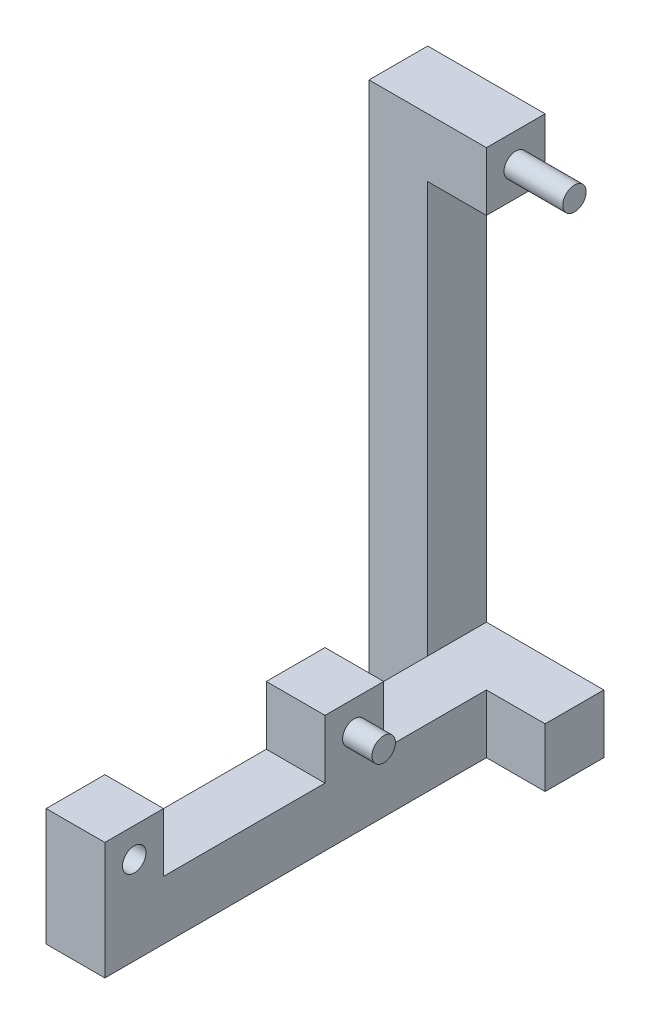
ISO-10303-21;
HEADER;
FILE_DESCRIPTION(('STEP AP214'),'2;1');
FILE_NAME('part.step','',(''),(''),'','','');
FILE_SCHEMA(('AUTOMOTIVE_DESIGN { 1 0 10303 214 1 1 1 1 }'));
ENDSEC;
DATA;
#1=APPLICATION_CONTEXT('core data for automotive mechanical design processes');
#2=APPLICATION_PROTOCOL_DEFINITION('international standard','automotive_design',2000,#1);
#3=PRODUCT_CONTEXT('',#1,'mechanical');
#4=PRODUCT('Part','Part','',(#3));
#5=PRODUCT_RELATED_PRODUCT_CATEGORY('part','',(#4));
#6=PRODUCT_DEFINITION_FORMATION('','',#4);
#7=PRODUCT_DEFINITION_CONTEXT('part definition',#1,'design');
#8=PRODUCT_DEFINITION('design','',#6,#7);
#9=PRODUCT_DEFINITION_SHAPE('','',#8);
#10=(LENGTH_UNIT() NAMED_UNIT(*) SI_UNIT(.MILLI.,.METRE.));
#11=(NAMED_UNIT(*) PLANE_ANGLE_UNIT() SI_UNIT($,.RADIAN.));
#12=(NAMED_UNIT(*) SI_UNIT($,.STERADIAN.) SOLID_ANGLE_UNIT());
#13=UNCERTAINTY_MEASURE_WITH_UNIT(LENGTH_MEASURE(1.E-05),#10,'distance_accuracy_value','');
#14=(GEOMETRIC_REPRESENTATION_CONTEXT(3) GLOBAL_UNCERTAINTY_ASSIGNED_CONTEXT((#13)) GLOBAL_UNIT_ASSIGNED_CONTEXT((#10,
#11,#12)) REPRESENTATION_CONTEXT('',''));
#15=CARTESIAN_POINT('',(0.,0.,0.));
#16=DIRECTION('',(0.,0.,1.));
#17=DIRECTION('',(1.,0.,0.));
#18=AXIS2_PLACEMENT_3D('',#15,#16,#17);
#19=CARTESIAN_POINT('',(400.,1700.,100.));
#20=DIRECTION('',(-1.,0.,0.));
#21=DIRECTION('',(0.,0.,1.));
#22=AXIS2_PLACEMENT_3D('',#19,#20,#21);
#23=CYLINDRICAL_SURFACE('',#22,40.);
#24=CARTESIAN_POINT('',(400.,1700.,100.));
#25=DIRECTION('',(1.,0.,0.));
#26=DIRECTION('',(0.,0.,-1.));
#27=AXIS2_PLACEMENT_3D('',#24,#25,#26);
#28=CIRCLE('',#27,40.);
#29=CARTESIAN_POINT('',(400.,1700.,60.));
#30=VERTEX_POINT('',#29);
#31=EDGE_CURVE('E12',#30,#30,#28,.T.);
#32=ORIENTED_EDGE('',*,*,#31,.F.);
#33=EDGE_LOOP('',(#32));
#34=FACE_BOUND('',#33,.T.);
#35=CARTESIAN_POINT('',(0.,1700.,100.));
#36=DIRECTION('',(1.,0.,0.));
#37=DIRECTION('',(0.,0.,-1.));
#38=AXIS2_PLACEMENT_3D('',#35,#36,#37);
#39=CIRCLE('',#38,40.);
#40=CARTESIAN_POINT('',(0.,1700.,60.));
#41=VERTEX_POINT('',#40);
#42=EDGE_CURVE('E74',#41,#41,#39,.T.);
#43=ORIENTED_EDGE('',*,*,#42,.T.);
#44=EDGE_LOOP('',(#43));
#45=FACE_BOUND('',#44,.T.);
#46=ADVANCED_FACE('F71',(#34,#45),#23,.T.);
#47=CARTESIAN_POINT('',(400.,1700.,100.));
#48=DIRECTION('',(1.,0.,0.));
#49=DIRECTION('',(0.,0.,-1.));
#50=AXIS2_PLACEMENT_3D('',#47,#48,#49);
#51=PLANE('',#50);
#52=ORIENTED_EDGE('',*,*,#31,.T.);
#53=EDGE_LOOP('',(#52));
#54=FACE_BOUND('',#53,.T.);
#55=ADVANCED_FACE('F86',(#54),#51,.T.);
#56=CARTESIAN_POINT('',(0.,1700.,100.));
#57=DIRECTION('',(1.,0.,0.));
#58=DIRECTION('',(0.,0.,-1.));
#59=AXIS2_PLACEMENT_3D('',#56,#57,#58);
#60=PLANE('',#59);
#61=ORIENTED_EDGE('',*,*,#42,.F.);
#62=EDGE_LOOP('',(#61));
#63=FACE_BOUND('',#62,.T.);
#64=ADVANCED_FACE('F84',(#63),#60,.F.);
#65=CLOSED_SHELL('',(#46,#55,#64));
#66=MANIFOLD_SOLID_BREP('B2',#65);
#67=CARTESIAN_POINT('',(200.,0.,0.));
#68=DIRECTION('',(-1.,0.,0.));
#69=DIRECTION('',(0.,0.,1.));
#70=AXIS2_PLACEMENT_3D('',#67,#68,#69);
#71=PLANE('',#70);
#72=CARTESIAN_POINT('',(200.,300.,1400.));
#73=DIRECTION('',(-1.,0.,0.));
#74=DIRECTION('',(0.,0.,1.));
#75=AXIS2_PLACEMENT_3D('',#72,#73,#74);
#76=CIRCLE('',#75,39.9999999999999);
#77=CARTESIAN_POINT('',(200.,300.,1440.));
#78=VERTEX_POINT('',#77);
#79=EDGE_CURVE('E265',#78,#78,#76,.T.);
#80=ORIENTED_EDGE('',*,*,#79,.T.);
#81=EDGE_LOOP('',(#80));
#82=FACE_BOUND('',#81,.T.);
#83=CARTESIAN_POINT('',(200.,300.,650.));
#84=DIRECTION('',(-1.,0.,0.));
#85=DIRECTION('',(0.,0.,1.));
#86=AXIS2_PLACEMENT_3D('',#83,#84,#85);
#87=CIRCLE('',#86,39.9999999999999);
#88=CARTESIAN_POINT('',(200.,300.,690.));
#89=VERTEX_POINT('',#88);
#90=EDGE_CURVE('E69',#89,#89,#87,.F.);
#91=ORIENTED_EDGE('',*,*,#90,.F.);
#92=EDGE_LOOP('',(#91));
#93=FACE_BOUND('',#92,.T.);
#94=DIRECTION('',(0.,-1.,0.));
#95=VECTOR('',#94,1.);
#96=CARTESIAN_POINT('',(200.,0.,200.));
#97=LINE('',#96,#95);
#98=CARTESIAN_POINT('',(200.,200.,200.));
#99=VERTEX_POINT('',#98);
#100=CARTESIAN_POINT('',(200.,0.,200.));
#101=VERTEX_POINT('',#100);
#102=EDGE_CURVE('E272',#99,#101,#97,.T.);
#103=ORIENTED_EDGE('',*,*,#102,.F.);
#104=DIRECTION('',(0.,0.,1.));
#105=VECTOR('',#104,1.);
#106=CARTESIAN_POINT('',(200.,200.,0.));
#107=LINE('',#106,#105);
#108=CARTESIAN_POINT('',(200.,200.,550.));
#109=VERTEX_POINT('',#108);
#110=EDGE_CURVE('E314',#99,#109,#107,.T.);
#111=ORIENTED_EDGE('',*,*,#110,.T.);
#112=DIRECTION('',(0.,1.,0.));
#113=VECTOR('',#112,1.);
#114=CARTESIAN_POINT('',(200.,200.,550.));
#115=LINE('',#114,#113);
#116=CARTESIAN_POINT('',(200.,400.,550.));
#117=VERTEX_POINT('',#116);
#118=EDGE_CURVE('E360',#109,#117,#115,.T.);
#119=ORIENTED_EDGE('',*,*,#118,.T.);
#120=DIRECTION('',(0.,0.,-1.));
#121=VECTOR('',#120,1.);
#122=CARTESIAN_POINT('',(200.,400.,750.));
#123=LINE('',#122,#121);
#124=CARTESIAN_POINT('',(200.,400.,750.));
#125=VERTEX_POINT('',#124);
#126=EDGE_CURVE('E356',#125,#117,#123,.T.);
#127=ORIENTED_EDGE('',*,*,#126,.F.);
#128=DIRECTION('',(0.,1.,0.));
#129=VECTOR('',#128,1.);
#130=CARTESIAN_POINT('',(200.,200.,750.));
#131=LINE('',#130,#129);
#132=CARTESIAN_POINT('',(200.,200.,750.));
#133=VERTEX_POINT('',#132);
#134=EDGE_CURVE('E353',#133,#125,#131,.T.);
#135=ORIENTED_EDGE('',*,*,#134,.F.);
#136=CARTESIAN_POINT('',(200.,200.,1300.));
#137=VERTEX_POINT('',#136);
#138=EDGE_CURVE('E317',#133,#137,#107,.T.);
#139=ORIENTED_EDGE('',*,*,#138,.T.);
#140=DIRECTION('',(0.,1.,0.));
#141=VECTOR('',#140,1.);
#142=CARTESIAN_POINT('',(200.,200.,1300.));
#143=LINE('',#142,#141);
#144=CARTESIAN_POINT('',(200.,400.,1300.));
#145=VERTEX_POINT('',#144);
#146=EDGE_CURVE('E333',#137,#145,#143,.T.);
#147=ORIENTED_EDGE('',*,*,#146,.T.);
#148=DIRECTION('',(0.,0.,-1.));
#149=VECTOR('',#148,1.);
#150=CARTESIAN_POINT('',(200.,400.,1500.));
#151=LINE('',#150,#149);
#152=CARTESIAN_POINT('',(200.,400.,1500.));
#153=VERTEX_POINT('',#152);
#154=EDGE_CURVE('E335',#153,#145,#151,.T.);
#155=ORIENTED_EDGE('',*,*,#154,.F.);
#156=DIRECTION('',(0.,1.,0.));
#157=VECTOR('',#156,1.);
#158=CARTESIAN_POINT('',(200.,0.,1500.));
#159=LINE('',#158,#157);
#160=CARTESIAN_POINT('',(200.,0.,1500.));
#161=VERTEX_POINT('',#160);
#162=EDGE_CURVE('E316',#161,#153,#159,.T.);
#163=ORIENTED_EDGE('',*,*,#162,.F.);
#164=DIRECTION('',(0.,0.,1.));
#165=VECTOR('',#164,1.);
#166=CARTESIAN_POINT('',(200.,0.,0.));
#167=LINE('',#166,#165);
#168=EDGE_CURVE('E248',#101,#161,#167,.T.);
#169=ORIENTED_EDGE('',*,*,#168,.F.);
#170=EDGE_LOOP('',(#103,#111,#119,#127,#135,#139,#147,#155,#163,#169));
#171=FACE_BOUND('',#170,.T.);
#172=ADVANCED_FACE('F114',(#82,#93,#171),#71,.F.);
#173=CARTESIAN_POINT('',(0.,0.,0.));
#174=DIRECTION('',(1.,0.,0.));
#175=DIRECTION('',(0.,0.,-1.));
#176=AXIS2_PLACEMENT_3D('',#173,#174,#175);
#177=PLANE('',#176);
#178=DIRECTION('',(0.,1.,0.));
#179=VECTOR('',#178,1.);
#180=CARTESIAN_POINT('',(0.,0.,0.));
#181=LINE('',#180,#179);
#182=CARTESIAN_POINT('',(0.,200.,0.));
#183=VERTEX_POINT('',#182);
#184=CARTESIAN_POINT('',(0.,1600.,0.));
#185=VERTEX_POINT('',#184);
#186=EDGE_CURVE('E139',#183,#185,#181,.T.);
#187=ORIENTED_EDGE('',*,*,#186,.T.);
#188=DIRECTION('',(0.,0.,-1.));
#189=VECTOR('',#188,1.);
#190=CARTESIAN_POINT('',(0.,1600.,200.));
#191=LINE('',#190,#189);
#192=CARTESIAN_POINT('',(0.,1600.,200.));
#193=VERTEX_POINT('',#192);
#194=EDGE_CURVE('E274',#193,#185,#191,.T.);
#195=ORIENTED_EDGE('',*,*,#194,.F.);
#196=DIRECTION('',(0.,-1.,0.));
#197=VECTOR('',#196,1.);
#198=CARTESIAN_POINT('',(0.,0.,200.));
#199=LINE('',#198,#197);
#200=CARTESIAN_POINT('',(0.,200.,200.));
#201=VERTEX_POINT('',#200);
#202=EDGE_CURVE('E296',#193,#201,#199,.T.);
#203=ORIENTED_EDGE('',*,*,#202,.T.);
#204=DIRECTION('',(0.,0.,1.));
#205=VECTOR('',#204,1.);
#206=CARTESIAN_POINT('',(0.,200.,0.));
#207=LINE('',#206,#205);
#208=EDGE_CURVE('E320',#183,#201,#207,.T.);
#209=ORIENTED_EDGE('',*,*,#208,.F.);
#210=EDGE_LOOP('',(#187,#195,#203,#209));
#211=FACE_BOUND('',#210,.T.);
#212=ADVANCED_FACE('F419',(#211),#177,.T.);
#213=CARTESIAN_POINT('',(0.,0.,0.));
#214=DIRECTION('',(-1.,0.,0.));
#215=DIRECTION('',(0.,0.,1.));
#216=AXIS2_PLACEMENT_3D('',#213,#214,#215);
#217=PLANE('',#216);
#218=CARTESIAN_POINT('',(0.,300.,1400.));
#219=DIRECTION('',(-1.,0.,0.));
#220=DIRECTION('',(0.,0.,1.));
#221=AXIS2_PLACEMENT_3D('',#218,#219,#220);
#222=CIRCLE('',#221,39.9999999999999);
#223=CARTESIAN_POINT('',(0.,300.,1440.));
#224=VERTEX_POINT('',#223);
#225=EDGE_CURVE('E118',#224,#224,#222,.T.);
#226=ORIENTED_EDGE('',*,*,#225,.F.);
#227=EDGE_LOOP('',(#226));
#228=FACE_BOUND('',#227,.T.);
#229=CARTESIAN_POINT('',(0.,200.,550.));
#230=VERTEX_POINT('',#229);
#231=EDGE_CURVE('E323',#201,#230,#207,.T.);
#232=ORIENTED_EDGE('',*,*,#231,.F.);
#233=CARTESIAN_POINT('',(0.,0.,200.));
#234=VERTEX_POINT('',#233);
#235=EDGE_CURVE('E123',#201,#234,#199,.T.);
#236=ORIENTED_EDGE('',*,*,#235,.T.);
#237=DIRECTION('',(0.,0.,1.));
#238=VECTOR('',#237,1.);
#239=CARTESIAN_POINT('',(0.,0.,0.));
#240=LINE('',#239,#238);
#241=CARTESIAN_POINT('',(0.,0.,1500.));
#242=VERTEX_POINT('',#241);
#243=EDGE_CURVE('E326',#234,#242,#240,.T.);
#244=ORIENTED_EDGE('',*,*,#243,.T.);
#245=DIRECTION('',(0.,1.,0.));
#246=VECTOR('',#245,1.);
#247=CARTESIAN_POINT('',(0.,0.,1500.));
#248=LINE('',#247,#246);
#249=CARTESIAN_POINT('',(0.,400.,1500.));
#250=VERTEX_POINT('',#249);
#251=EDGE_CURVE('E322',#242,#250,#248,.T.);
#252=ORIENTED_EDGE('',*,*,#251,.T.);
#253=DIRECTION('',(0.,0.,-1.));
#254=VECTOR('',#253,1.);
#255=CARTESIAN_POINT('',(0.,400.,1500.));
#256=LINE('',#255,#254);
#257=CARTESIAN_POINT('',(0.,400.,1300.));
#258=VERTEX_POINT('',#257);
#259=EDGE_CURVE('E336',#250,#258,#256,.T.);
#260=ORIENTED_EDGE('',*,*,#259,.T.);
#261=DIRECTION('',(0.,1.,0.));
#262=VECTOR('',#261,1.);
#263=CARTESIAN_POINT('',(0.,200.,1300.));
#264=LINE('',#263,#262);
#265=CARTESIAN_POINT('',(0.,200.,1300.));
#266=VERTEX_POINT('',#265);
#267=EDGE_CURVE('E340',#266,#258,#264,.T.);
#268=ORIENTED_EDGE('',*,*,#267,.F.);
#269=CARTESIAN_POINT('',(0.,200.,750.));
#270=VERTEX_POINT('',#269);
#271=EDGE_CURVE('E324',#270,#266,#207,.T.);
#272=ORIENTED_EDGE('',*,*,#271,.F.);
#273=DIRECTION('',(0.,1.,0.));
#274=VECTOR('',#273,1.);
#275=CARTESIAN_POINT('',(0.,200.,750.));
#276=LINE('',#275,#274);
#277=CARTESIAN_POINT('',(0.,400.,750.));
#278=VERTEX_POINT('',#277);
#279=EDGE_CURVE('E310',#270,#278,#276,.T.);
#280=ORIENTED_EDGE('',*,*,#279,.T.);
#281=DIRECTION('',(0.,0.,-1.));
#282=VECTOR('',#281,1.);
#283=CARTESIAN_POINT('',(0.,400.,750.));
#284=LINE('',#283,#282);
#285=CARTESIAN_POINT('',(0.,400.,550.));
#286=VERTEX_POINT('',#285);
#287=EDGE_CURVE('E365',#278,#286,#284,.T.);
#288=ORIENTED_EDGE('',*,*,#287,.T.);
#289=DIRECTION('',(0.,1.,0.));
#290=VECTOR('',#289,1.);
#291=CARTESIAN_POINT('',(0.,200.,550.));
#292=LINE('',#291,#290);
#293=EDGE_CURVE('E357',#230,#286,#292,.T.);
#294=ORIENTED_EDGE('',*,*,#293,.F.);
#295=EDGE_LOOP('',(#232,#236,#244,#252,#260,#268,#272,#280,#288,#294));
#296=FACE_BOUND('',#295,.T.);
#297=ADVANCED_FACE('F385',(#228,#296),#217,.T.);
#298=CARTESIAN_POINT('',(200.,0.,0.));
#299=DIRECTION('',(0.,-1.,0.));
#300=DIRECTION('',(0.,0.,-1.));
#301=AXIS2_PLACEMENT_3D('',#298,#299,#300);
#302=PLANE('',#301);
#303=DIRECTION('',(-1.,0.,0.));
#304=VECTOR('',#303,1.);
#305=CARTESIAN_POINT('',(400.,0.,200.));
#306=LINE('',#305,#304);
#307=CARTESIAN_POINT('',(400.,0.,200.));
#308=VERTEX_POINT('',#307);
#309=EDGE_CURVE('E131',#308,#101,#306,.T.);
#310=ORIENTED_EDGE('',*,*,#309,.T.);
#311=ORIENTED_EDGE('',*,*,#168,.T.);
#312=DIRECTION('',(-1.,0.,0.));
#313=VECTOR('',#312,1.);
#314=CARTESIAN_POINT('',(200.,0.,1500.));
#315=LINE('',#314,#313);
#316=EDGE_CURVE('E329',#161,#242,#315,.T.);
#317=ORIENTED_EDGE('',*,*,#316,.T.);
#318=ORIENTED_EDGE('',*,*,#243,.F.);
#319=DIRECTION('',(1.,0.,0.));
#320=VECTOR('',#319,1.);
#321=CARTESIAN_POINT('',(-200.,0.,200.));
#322=LINE('',#321,#320);
#323=CARTESIAN_POINT('',(-200.,0.,200.));
#324=VERTEX_POINT('',#323);
#325=EDGE_CURVE('E308',#324,#234,#322,.T.);
#326=ORIENTED_EDGE('',*,*,#325,.F.);
#327=DIRECTION('',(0.,0.,-1.));
#328=VECTOR('',#327,1.);
#329=CARTESIAN_POINT('',(-200.,0.,0.));
#330=LINE('',#329,#328);
#331=CARTESIAN_POINT('',(-200.,0.,0.));
#332=VERTEX_POINT('',#331);
#333=EDGE_CURVE('E302',#324,#332,#330,.T.);
#334=ORIENTED_EDGE('',*,*,#333,.T.);
#335=DIRECTION('',(-1.,0.,0.));
#336=VECTOR('',#335,1.);
#337=CARTESIAN_POINT('',(200.,0.,0.));
#338=LINE('',#337,#336);
#339=CARTESIAN_POINT('',(400.,0.,0.));
#340=VERTEX_POINT('',#339);
#341=EDGE_CURVE('E247',#340,#332,#338,.T.);
#342=ORIENTED_EDGE('',*,*,#341,.F.);
#343=DIRECTION('',(0.,0.,-1.));
#344=VECTOR('',#343,1.);
#345=CARTESIAN_POINT('',(400.,0.,0.));
#346=LINE('',#345,#344);
#347=EDGE_CURVE('E261',#308,#340,#346,.T.);
#348=ORIENTED_EDGE('',*,*,#347,.F.);
#349=EDGE_LOOP('',(#310,#311,#317,#318,#326,#334,#342,#348));
#350=FACE_BOUND('',#349,.T.);
#351=ADVANCED_FACE('F400',(#350),#302,.T.);
#352=CARTESIAN_POINT('',(200.,0.,1500.));
#353=DIRECTION('',(0.,0.,1.));
#354=DIRECTION('',(1.,0.,0.));
#355=AXIS2_PLACEMENT_3D('',#352,#353,#354);
#356=PLANE('',#355);
#357=ORIENTED_EDGE('',*,*,#251,.F.);
#358=ORIENTED_EDGE('',*,*,#316,.F.);
#359=ORIENTED_EDGE('',*,*,#162,.T.);
#360=DIRECTION('',(-1.,0.,0.));
#361=VECTOR('',#360,1.);
#362=CARTESIAN_POINT('',(200.,400.,1500.));
#363=LINE('',#362,#361);
#364=EDGE_CURVE('E339',#153,#250,#363,.T.);
#365=ORIENTED_EDGE('',*,*,#364,.T.);
#366=EDGE_LOOP('',(#357,#358,#359,#365));
#367=FACE_BOUND('',#366,.T.);
#368=ADVANCED_FACE('F427',(#367),#356,.T.);
#369=CARTESIAN_POINT('',(200.,0.,0.));
#370=DIRECTION('',(0.,0.,1.));
#371=DIRECTION('',(1.,0.,0.));
#372=AXIS2_PLACEMENT_3D('',#369,#370,#371);
#373=PLANE('',#372);
#374=ORIENTED_EDGE('',*,*,#341,.T.);
#375=DIRECTION('',(0.,1.,0.));
#376=VECTOR('',#375,1.);
#377=CARTESIAN_POINT('',(-200.,0.,0.));
#378=LINE('',#377,#376);
#379=CARTESIAN_POINT('',(-200.,1800.,0.));
#380=VERTEX_POINT('',#379);
#381=EDGE_CURVE('E292',#332,#380,#378,.T.);
#382=ORIENTED_EDGE('',*,*,#381,.T.);
#383=DIRECTION('',(1.,0.,0.));
#384=VECTOR('',#383,1.);
#385=CARTESIAN_POINT('',(-200.,1800.,0.));
#386=LINE('',#385,#384);
#387=CARTESIAN_POINT('',(200.,1800.,0.));
#388=VERTEX_POINT('',#387);
#389=EDGE_CURVE('E305',#380,#388,#386,.T.);
#390=ORIENTED_EDGE('',*,*,#389,.T.);
#391=DIRECTION('',(0.,1.,0.));
#392=VECTOR('',#391,1.);
#393=CARTESIAN_POINT('',(200.,1800.,0.));
#394=LINE('',#393,#392);
#395=CARTESIAN_POINT('',(200.,1600.,0.));
#396=VERTEX_POINT('',#395);
#397=EDGE_CURVE('E280',#396,#388,#394,.T.);
#398=ORIENTED_EDGE('',*,*,#397,.F.);
#399=DIRECTION('',(-1.,0.,0.));
#400=VECTOR('',#399,1.);
#401=CARTESIAN_POINT('',(200.,1600.,0.));
#402=LINE('',#401,#400);
#403=EDGE_CURVE('E286',#396,#185,#402,.T.);
#404=ORIENTED_EDGE('',*,*,#403,.T.);
#405=ORIENTED_EDGE('',*,*,#186,.F.);
#406=DIRECTION('',(-1.,0.,0.));
#407=VECTOR('',#406,1.);
#408=CARTESIAN_POINT('',(200.,200.,0.));
#409=LINE('',#408,#407);
#410=CARTESIAN_POINT('',(400.,200.,0.));
#411=VERTEX_POINT('',#410);
#412=EDGE_CURVE('E239',#411,#183,#409,.T.);
#413=ORIENTED_EDGE('',*,*,#412,.F.);
#414=DIRECTION('',(0.,1.,0.));
#415=VECTOR('',#414,1.);
#416=CARTESIAN_POINT('',(400.,0.,0.));
#417=LINE('',#416,#415);
#418=EDGE_CURVE('E243',#340,#411,#417,.T.);
#419=ORIENTED_EDGE('',*,*,#418,.F.);
#420=EDGE_LOOP('',(#374,#382,#390,#398,#404,#405,#413,#419));
#421=FACE_BOUND('',#420,.T.);
#422=ADVANCED_FACE('F241',(#421),#373,.F.);
#423=CARTESIAN_POINT('',(200.,200.,0.));
#424=DIRECTION('',(0.,-1.,0.));
#425=DIRECTION('',(0.,0.,-1.));
#426=AXIS2_PLACEMENT_3D('',#423,#424,#425);
#427=PLANE('',#426);
#428=DIRECTION('',(-1.,0.,0.));
#429=VECTOR('',#428,1.);
#430=CARTESIAN_POINT('',(200.,200.,1300.));
#431=LINE('',#430,#429);
#432=EDGE_CURVE('E350',#137,#266,#431,.T.);
#433=ORIENTED_EDGE('',*,*,#432,.F.);
#434=ORIENTED_EDGE('',*,*,#138,.F.);
#435=DIRECTION('',(-1.,0.,0.));
#436=VECTOR('',#435,1.);
#437=CARTESIAN_POINT('',(200.,200.,750.));
#438=LINE('',#437,#436);
#439=EDGE_CURVE('E332',#133,#270,#438,.T.);
#440=ORIENTED_EDGE('',*,*,#439,.T.);
#441=ORIENTED_EDGE('',*,*,#271,.T.);
#442=EDGE_LOOP('',(#433,#434,#440,#441));
#443=FACE_BOUND('',#442,.T.);
#444=ADVANCED_FACE('F439',(#443),#427,.F.);
#445=ORIENTED_EDGE('',*,*,#208,.T.);
#446=ORIENTED_EDGE('',*,*,#231,.T.);
#447=DIRECTION('',(-1.,0.,0.));
#448=VECTOR('',#447,1.);
#449=CARTESIAN_POINT('',(200.,200.,550.));
#450=LINE('',#449,#448);
#451=EDGE_CURVE('E352',#109,#230,#450,.T.);
#452=ORIENTED_EDGE('',*,*,#451,.F.);
#453=ORIENTED_EDGE('',*,*,#110,.F.);
#454=DIRECTION('',(-1.,0.,0.));
#455=VECTOR('',#454,1.);
#456=CARTESIAN_POINT('',(400.,200.,200.));
#457=LINE('',#456,#455);
#458=CARTESIAN_POINT('',(400.,200.,200.));
#459=VERTEX_POINT('',#458);
#460=EDGE_CURVE('E254',#459,#99,#457,.T.);
#461=ORIENTED_EDGE('',*,*,#460,.F.);
#462=DIRECTION('',(0.,0.,1.));
#463=VECTOR('',#462,1.);
#464=CARTESIAN_POINT('',(400.,200.,0.));
#465=LINE('',#464,#463);
#466=EDGE_CURVE('E251',#411,#459,#465,.T.);
#467=ORIENTED_EDGE('',*,*,#466,.F.);
#468=ORIENTED_EDGE('',*,*,#412,.T.);
#469=EDGE_LOOP('',(#445,#446,#452,#453,#461,#467,#468));
#470=FACE_BOUND('',#469,.T.);
#471=ADVANCED_FACE('F252',(#470),#427,.F.);
#472=CARTESIAN_POINT('',(200.,400.,750.));
#473=DIRECTION('',(0.,1.,0.));
#474=DIRECTION('',(0.,0.,1.));
#475=AXIS2_PLACEMENT_3D('',#472,#473,#474);
#476=PLANE('',#475);
#477=ORIENTED_EDGE('',*,*,#287,.F.);
#478=DIRECTION('',(-1.,0.,0.));
#479=VECTOR('',#478,1.);
#480=CARTESIAN_POINT('',(200.,400.,750.));
#481=LINE('',#480,#479);
#482=EDGE_CURVE('E362',#125,#278,#481,.T.);
#483=ORIENTED_EDGE('',*,*,#482,.F.);
#484=ORIENTED_EDGE('',*,*,#126,.T.);
#485=DIRECTION('',(-1.,0.,0.));
#486=VECTOR('',#485,1.);
#487=CARTESIAN_POINT('',(200.,400.,550.));
#488=LINE('',#487,#486);
#489=EDGE_CURVE('E343',#117,#286,#488,.T.);
#490=ORIENTED_EDGE('',*,*,#489,.T.);
#491=EDGE_LOOP('',(#477,#483,#484,#490));
#492=FACE_BOUND('',#491,.T.);
#493=ADVANCED_FACE('F380',(#492),#476,.T.);
#494=CARTESIAN_POINT('',(200.,200.,750.));
#495=DIRECTION('',(0.,0.,1.));
#496=DIRECTION('',(1.,0.,0.));
#497=AXIS2_PLACEMENT_3D('',#494,#495,#496);
#498=PLANE('',#497);
#499=ORIENTED_EDGE('',*,*,#279,.F.);
#500=ORIENTED_EDGE('',*,*,#439,.F.);
#501=ORIENTED_EDGE('',*,*,#134,.T.);
#502=ORIENTED_EDGE('',*,*,#482,.T.);
#503=EDGE_LOOP('',(#499,#500,#501,#502));
#504=FACE_BOUND('',#503,.T.);
#505=ADVANCED_FACE('F116',(#504),#498,.T.);
#506=CARTESIAN_POINT('',(200.,200.,550.));
#507=DIRECTION('',(0.,0.,1.));
#508=DIRECTION('',(1.,0.,0.));
#509=AXIS2_PLACEMENT_3D('',#506,#507,#508);
#510=PLANE('',#509);
#511=ORIENTED_EDGE('',*,*,#293,.T.);
#512=ORIENTED_EDGE('',*,*,#489,.F.);
#513=ORIENTED_EDGE('',*,*,#118,.F.);
#514=ORIENTED_EDGE('',*,*,#451,.T.);
#515=EDGE_LOOP('',(#511,#512,#513,#514));
#516=FACE_BOUND('',#515,.T.);
#517=ADVANCED_FACE('F393',(#516),#510,.F.);
#518=CARTESIAN_POINT('',(200.,400.,1500.));
#519=DIRECTION('',(0.,1.,0.));
#520=DIRECTION('',(0.,0.,1.));
#521=AXIS2_PLACEMENT_3D('',#518,#519,#520);
#522=PLANE('',#521);
#523=ORIENTED_EDGE('',*,*,#259,.F.);
#524=ORIENTED_EDGE('',*,*,#364,.F.);
#525=ORIENTED_EDGE('',*,*,#154,.T.);
#526=DIRECTION('',(-1.,0.,0.));
#527=VECTOR('',#526,1.);
#528=CARTESIAN_POINT('',(200.,400.,1300.));
#529=LINE('',#528,#527);
#530=EDGE_CURVE('E348',#145,#258,#529,.T.);
#531=ORIENTED_EDGE('',*,*,#530,.T.);
#532=EDGE_LOOP('',(#523,#524,#525,#531));
#533=FACE_BOUND('',#532,.T.);
#534=ADVANCED_FACE('F431',(#533),#522,.T.);
#535=CARTESIAN_POINT('',(200.,200.,1300.));
#536=DIRECTION('',(0.,0.,1.));
#537=DIRECTION('',(1.,0.,0.));
#538=AXIS2_PLACEMENT_3D('',#535,#536,#537);
#539=PLANE('',#538);
#540=ORIENTED_EDGE('',*,*,#267,.T.);
#541=ORIENTED_EDGE('',*,*,#530,.F.);
#542=ORIENTED_EDGE('',*,*,#146,.F.);
#543=ORIENTED_EDGE('',*,*,#432,.T.);
#544=EDGE_LOOP('',(#540,#541,#542,#543));
#545=FACE_BOUND('',#544,.T.);
#546=ADVANCED_FACE('F436',(#545),#539,.F.);
#547=CARTESIAN_POINT('',(-200.,0.,200.));
#548=DIRECTION('',(0.,0.,1.));
#549=DIRECTION('',(1.,0.,0.));
#550=AXIS2_PLACEMENT_3D('',#547,#548,#549);
#551=PLANE('',#550);
#552=ORIENTED_EDGE('',*,*,#202,.F.);
#553=DIRECTION('',(-1.,0.,0.));
#554=VECTOR('',#553,1.);
#555=CARTESIAN_POINT('',(200.,1600.,200.));
#556=LINE('',#555,#554);
#557=CARTESIAN_POINT('',(200.,1600.,200.));
#558=VERTEX_POINT('',#557);
#559=EDGE_CURVE('E289',#558,#193,#556,.T.);
#560=ORIENTED_EDGE('',*,*,#559,.F.);
#561=DIRECTION('',(0.,-1.,0.));
#562=VECTOR('',#561,1.);
#563=CARTESIAN_POINT('',(200.,1800.,200.));
#564=LINE('',#563,#562);
#565=CARTESIAN_POINT('',(200.,1800.,200.));
#566=VERTEX_POINT('',#565);
#567=EDGE_CURVE('E275',#566,#558,#564,.T.);
#568=ORIENTED_EDGE('',*,*,#567,.F.);
#569=DIRECTION('',(1.,0.,0.));
#570=VECTOR('',#569,1.);
#571=CARTESIAN_POINT('',(-200.,1800.,200.));
#572=LINE('',#571,#570);
#573=CARTESIAN_POINT('',(-200.,1800.,200.));
#574=VERTEX_POINT('',#573);
#575=EDGE_CURVE('E311',#574,#566,#572,.T.);
#576=ORIENTED_EDGE('',*,*,#575,.F.);
#577=DIRECTION('',(0.,-1.,0.));
#578=VECTOR('',#577,1.);
#579=CARTESIAN_POINT('',(-200.,0.,200.));
#580=LINE('',#579,#578);
#581=EDGE_CURVE('E299',#574,#324,#580,.T.);
#582=ORIENTED_EDGE('',*,*,#581,.T.);
#583=ORIENTED_EDGE('',*,*,#325,.T.);
#584=ORIENTED_EDGE('',*,*,#235,.F.);
#585=EDGE_LOOP('',(#552,#560,#568,#576,#582,#583,#584));
#586=FACE_BOUND('',#585,.T.);
#587=ADVANCED_FACE('F422',(#586),#551,.T.);
#588=CARTESIAN_POINT('',(-200.,1800.,0.));
#589=DIRECTION('',(0.,1.,0.));
#590=DIRECTION('',(0.,0.,1.));
#591=AXIS2_PLACEMENT_3D('',#588,#589,#590);
#592=PLANE('',#591);
#593=ORIENTED_EDGE('',*,*,#575,.T.);
#594=DIRECTION('',(0.,0.,1.));
#595=VECTOR('',#594,1.);
#596=CARTESIAN_POINT('',(200.,1800.,200.));
#597=LINE('',#596,#595);
#598=EDGE_CURVE('E283',#388,#566,#597,.T.);
#599=ORIENTED_EDGE('',*,*,#598,.F.);
#600=ORIENTED_EDGE('',*,*,#389,.F.);
#601=DIRECTION('',(0.,0.,1.));
#602=VECTOR('',#601,1.);
#603=CARTESIAN_POINT('',(-200.,1800.,0.));
#604=LINE('',#603,#602);
#605=EDGE_CURVE('E295',#380,#574,#604,.T.);
#606=ORIENTED_EDGE('',*,*,#605,.T.);
#607=EDGE_LOOP('',(#593,#599,#600,#606));
#608=FACE_BOUND('',#607,.T.);
#609=ADVANCED_FACE('F408',(#608),#592,.T.);
#610=CARTESIAN_POINT('',(-200.,0.,0.));
#611=DIRECTION('',(1.,0.,0.));
#612=DIRECTION('',(0.,0.,-1.));
#613=AXIS2_PLACEMENT_3D('',#610,#611,#612);
#614=PLANE('',#613);
#615=ORIENTED_EDGE('',*,*,#381,.F.);
#616=ORIENTED_EDGE('',*,*,#333,.F.);
#617=ORIENTED_EDGE('',*,*,#581,.F.);
#618=ORIENTED_EDGE('',*,*,#605,.F.);
#619=EDGE_LOOP('',(#615,#616,#617,#618));
#620=FACE_BOUND('',#619,.T.);
#621=ADVANCED_FACE('F405',(#620),#614,.F.);
#622=CARTESIAN_POINT('',(200.,1600.,200.));
#623=DIRECTION('',(0.,1.,0.));
#624=DIRECTION('',(0.,0.,1.));
#625=AXIS2_PLACEMENT_3D('',#622,#623,#624);
#626=PLANE('',#625);
#627=ORIENTED_EDGE('',*,*,#194,.T.);
#628=ORIENTED_EDGE('',*,*,#403,.F.);
#629=DIRECTION('',(0.,0.,-1.));
#630=VECTOR('',#629,1.);
#631=CARTESIAN_POINT('',(200.,1600.,200.));
#632=LINE('',#631,#630);
#633=EDGE_CURVE('E278',#558,#396,#632,.T.);
#634=ORIENTED_EDGE('',*,*,#633,.F.);
#635=ORIENTED_EDGE('',*,*,#559,.T.);
#636=EDGE_LOOP('',(#627,#628,#634,#635));
#637=FACE_BOUND('',#636,.T.);
#638=ADVANCED_FACE('F417',(#637),#626,.F.);
#639=CARTESIAN_POINT('',(200.,0.,0.));
#640=DIRECTION('',(1.,0.,0.));
#641=DIRECTION('',(0.,0.,-1.));
#642=AXIS2_PLACEMENT_3D('',#639,#640,#641);
#643=PLANE('',#642);
#644=ORIENTED_EDGE('',*,*,#567,.T.);
#645=ORIENTED_EDGE('',*,*,#633,.T.);
#646=ORIENTED_EDGE('',*,*,#397,.T.);
#647=ORIENTED_EDGE('',*,*,#598,.T.);
#648=EDGE_LOOP('',(#644,#645,#646,#647));
#649=FACE_BOUND('',#648,.T.);
#650=ADVANCED_FACE('F412',(#649),#643,.T.);
#651=CARTESIAN_POINT('',(400.,0.,200.));
#652=DIRECTION('',(0.,0.,-1.));
#653=DIRECTION('',(-1.,0.,0.));
#654=AXIS2_PLACEMENT_3D('',#651,#652,#653);
#655=PLANE('',#654);
#656=ORIENTED_EDGE('',*,*,#460,.T.);
#657=ORIENTED_EDGE('',*,*,#102,.T.);
#658=ORIENTED_EDGE('',*,*,#309,.F.);
#659=DIRECTION('',(0.,-1.,0.));
#660=VECTOR('',#659,1.);
#661=CARTESIAN_POINT('',(400.,0.,200.));
#662=LINE('',#661,#660);
#663=EDGE_CURVE('E257',#459,#308,#662,.T.);
#664=ORIENTED_EDGE('',*,*,#663,.F.);
#665=EDGE_LOOP('',(#656,#657,#658,#664));
#666=FACE_BOUND('',#665,.T.);
#667=ADVANCED_FACE('F399',(#666),#655,.F.);
#668=CARTESIAN_POINT('',(400.,0.,0.));
#669=DIRECTION('',(1.,0.,0.));
#670=DIRECTION('',(0.,0.,-1.));
#671=AXIS2_PLACEMENT_3D('',#668,#669,#670);
#672=PLANE('',#671);
#673=ORIENTED_EDGE('',*,*,#418,.T.);
#674=ORIENTED_EDGE('',*,*,#466,.T.);
#675=ORIENTED_EDGE('',*,*,#663,.T.);
#676=ORIENTED_EDGE('',*,*,#347,.T.);
#677=EDGE_LOOP('',(#673,#674,#675,#676));
#678=FACE_BOUND('',#677,.T.);
#679=ADVANCED_FACE('F260',(#678),#672,.T.);
#680=CARTESIAN_POINT('',(300.,300.,650.));
#681=DIRECTION('',(-1.,0.,0.));
#682=DIRECTION('',(0.,0.,1.));
#683=AXIS2_PLACEMENT_3D('',#680,#681,#682);
#684=CYLINDRICAL_SURFACE('',#683,39.9999999999999);
#685=CARTESIAN_POINT('',(300.,300.,650.));
#686=DIRECTION('',(1.,0.,0.));
#687=DIRECTION('',(0.,0.,-1.));
#688=AXIS2_PLACEMENT_3D('',#685,#686,#687);
#689=CIRCLE('',#688,39.9999999999999);
#690=CARTESIAN_POINT('',(300.,300.,610.));
#691=VERTEX_POINT('',#690);
#692=EDGE_CURVE('E262',#691,#691,#689,.T.);
#693=ORIENTED_EDGE('',*,*,#692,.F.);
#694=EDGE_LOOP('',(#693));
#695=FACE_BOUND('',#694,.T.);
#696=ORIENTED_EDGE('',*,*,#90,.T.);
#697=EDGE_LOOP('',(#696));
#698=FACE_BOUND('',#697,.T.);
#699=ADVANCED_FACE('F504',(#695,#698),#684,.T.);
#700=CARTESIAN_POINT('',(300.,300.,650.));
#701=DIRECTION('',(1.,0.,0.));
#702=DIRECTION('',(0.,0.,-1.));
#703=AXIS2_PLACEMENT_3D('',#700,#701,#702);
#704=PLANE('',#703);
#705=ORIENTED_EDGE('',*,*,#692,.T.);
#706=EDGE_LOOP('',(#705));
#707=FACE_BOUND('',#706,.T.);
#708=ADVANCED_FACE('F513',(#707),#704,.T.);
#709=CARTESIAN_POINT('',(-200.,300.,1400.));
#710=DIRECTION('',(1.,0.,0.));
#711=DIRECTION('',(0.,0.,-1.));
#712=AXIS2_PLACEMENT_3D('',#709,#710,#711);
#713=CYLINDRICAL_SURFACE('',#712,39.9999999999999);
#714=ORIENTED_EDGE('',*,*,#225,.T.);
#715=EDGE_LOOP('',(#714));
#716=FACE_BOUND('',#715,.T.);
#717=ORIENTED_EDGE('',*,*,#79,.F.);
#718=EDGE_LOOP('',(#717));
#719=FACE_BOUND('',#718,.T.);
#720=ADVANCED_FACE('F522',(#716,#719),#713,.F.);
#721=CLOSED_SHELL('',(#172,#212,#297,#351,#368,#422,#444,#471,#493,#505,#517,#534,#546,#587,
#609,#621,#638,#650,#667,#679,#699,#708,#720));
#722=MANIFOLD_SOLID_BREP('B7',#721);
#723=ADVANCED_BREP_SHAPE_REPRESENTATION('',(#18,#66,#722),#14);
#724=SHAPE_DEFINITION_REPRESENTATION(#9,#723);
ENDSEC;
END-ISO-10303-21;
